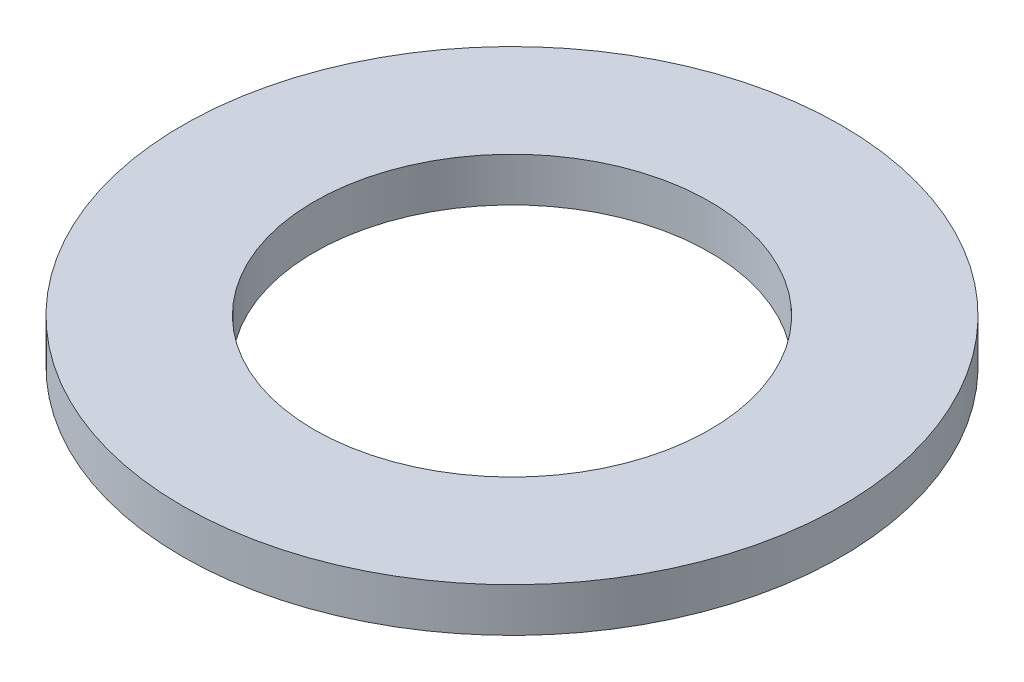
ISO-10303-21;
HEADER;
FILE_DESCRIPTION(('STEP AP214'),'2;1');
FILE_NAME('part.step','',(''),(''),'','','');
FILE_SCHEMA(('AUTOMOTIVE_DESIGN { 1 0 10303 214 1 1 1 1 }'));
ENDSEC;
DATA;
#1=APPLICATION_CONTEXT('core data for automotive mechanical design processes');
#2=APPLICATION_PROTOCOL_DEFINITION('international standard','automotive_design',2000,#1);
#3=PRODUCT_CONTEXT('',#1,'mechanical');
#4=PRODUCT('Part','Part','',(#3));
#5=PRODUCT_RELATED_PRODUCT_CATEGORY('part','',(#4));
#6=PRODUCT_DEFINITION_FORMATION('','',#4);
#7=PRODUCT_DEFINITION_CONTEXT('part definition',#1,'design');
#8=PRODUCT_DEFINITION('design','',#6,#7);
#9=PRODUCT_DEFINITION_SHAPE('','',#8);
#10=(LENGTH_UNIT() NAMED_UNIT(*) SI_UNIT(.MILLI.,.METRE.));
#11=(NAMED_UNIT(*) PLANE_ANGLE_UNIT() SI_UNIT($,.RADIAN.));
#12=(NAMED_UNIT(*) SI_UNIT($,.STERADIAN.) SOLID_ANGLE_UNIT());
#13=UNCERTAINTY_MEASURE_WITH_UNIT(LENGTH_MEASURE(1.E-05),#10,'distance_accuracy_value','');
#14=(GEOMETRIC_REPRESENTATION_CONTEXT(3) GLOBAL_UNCERTAINTY_ASSIGNED_CONTEXT((#13)) GLOBAL_UNIT_ASSIGNED_CONTEXT((#10,
#11,#12)) REPRESENTATION_CONTEXT('',''));
#15=CARTESIAN_POINT('',(0.,0.,0.));
#16=DIRECTION('',(0.,0.,1.));
#17=DIRECTION('',(1.,0.,0.));
#18=AXIS2_PLACEMENT_3D('',#15,#16,#17);
#19=CARTESIAN_POINT('',(0.,10.,0.));
#20=DIRECTION('',(0.,-1.,0.));
#21=DIRECTION('',(0.,0.,-1.));
#22=AXIS2_PLACEMENT_3D('',#19,#20,#21);
#23=CYLINDRICAL_SURFACE('',#22,75.);
#24=CARTESIAN_POINT('',(0.,10.,0.));
#25=DIRECTION('',(0.,1.,0.));
#26=DIRECTION('',(0.,0.,1.));
#27=AXIS2_PLACEMENT_3D('',#24,#25,#26);
#28=CIRCLE('',#27,75.);
#29=CARTESIAN_POINT('',(0.,10.,75.));
#30=VERTEX_POINT('',#29);
#31=EDGE_CURVE('E10',#30,#30,#28,.T.);
#32=ORIENTED_EDGE('',*,*,#31,.F.);
#33=EDGE_LOOP('',(#32));
#34=FACE_BOUND('',#33,.T.);
#35=CARTESIAN_POINT('',(0.,0.,0.));
#36=DIRECTION('',(0.,1.,0.));
#37=DIRECTION('',(0.,0.,1.));
#38=AXIS2_PLACEMENT_3D('',#35,#36,#37);
#39=CIRCLE('',#38,75.);
#40=CARTESIAN_POINT('',(0.,0.,75.));
#41=VERTEX_POINT('',#40);
#42=EDGE_CURVE('E37',#41,#41,#39,.T.);
#43=ORIENTED_EDGE('',*,*,#42,.T.);
#44=EDGE_LOOP('',(#43));
#45=FACE_BOUND('',#44,.T.);
#46=ADVANCED_FACE('F40',(#34,#45),#23,.T.);
#47=CARTESIAN_POINT('',(0.,10.,0.));
#48=DIRECTION('',(0.,1.,0.));
#49=DIRECTION('',(0.,0.,1.));
#50=AXIS2_PLACEMENT_3D('',#47,#48,#49);
#51=PLANE('',#50);
#52=CARTESIAN_POINT('',(0.,10.,0.));
#53=DIRECTION('',(0.,1.,0.));
#54=DIRECTION('',(0.,0.,1.));
#55=AXIS2_PLACEMENT_3D('',#52,#53,#54);
#56=CIRCLE('',#55,45.);
#57=CARTESIAN_POINT('',(0.,10.,45.));
#58=VERTEX_POINT('',#57);
#59=EDGE_CURVE('E50',#58,#58,#56,.T.);
#60=ORIENTED_EDGE('',*,*,#59,.F.);
#61=EDGE_LOOP('',(#60));
#62=FACE_BOUND('',#61,.T.);
#63=ORIENTED_EDGE('',*,*,#31,.T.);
#64=EDGE_LOOP('',(#63));
#65=FACE_BOUND('',#64,.T.);
#66=ADVANCED_FACE('F59',(#62,#65),#51,.T.);
#67=CARTESIAN_POINT('',(0.,0.,0.));
#68=DIRECTION('',(0.,1.,0.));
#69=DIRECTION('',(0.,0.,1.));
#70=AXIS2_PLACEMENT_3D('',#67,#68,#69);
#71=PLANE('',#70);
#72=CARTESIAN_POINT('',(0.,0.,0.));
#73=DIRECTION('',(0.,1.,0.));
#74=DIRECTION('',(0.,0.,1.));
#75=AXIS2_PLACEMENT_3D('',#72,#73,#74);
#76=CIRCLE('',#75,45.);
#77=CARTESIAN_POINT('',(0.,0.,45.));
#78=VERTEX_POINT('',#77);
#79=EDGE_CURVE('E47',#78,#78,#76,.T.);
#80=ORIENTED_EDGE('',*,*,#79,.T.);
#81=EDGE_LOOP('',(#80));
#82=FACE_BOUND('',#81,.T.);
#83=ORIENTED_EDGE('',*,*,#42,.F.);
#84=EDGE_LOOP('',(#83));
#85=FACE_BOUND('',#84,.T.);
#86=ADVANCED_FACE('F58',(#82,#85),#71,.F.);
#87=CARTESIAN_POINT('',(0.,10.,0.));
#88=DIRECTION('',(0.,-1.,0.));
#89=DIRECTION('',(0.,0.,-1.));
#90=AXIS2_PLACEMENT_3D('',#87,#88,#89);
#91=CYLINDRICAL_SURFACE('',#90,45.);
#92=ORIENTED_EDGE('',*,*,#59,.T.);
#93=EDGE_LOOP('',(#92));
#94=FACE_BOUND('',#93,.T.);
#95=ORIENTED_EDGE('',*,*,#79,.F.);
#96=EDGE_LOOP('',(#95));
#97=FACE_BOUND('',#96,.T.);
#98=ADVANCED_FACE('F54',(#94,#97),#91,.F.);
#99=CLOSED_SHELL('',(#46,#66,#86,#98));
#100=MANIFOLD_SOLID_BREP('B2',#99);
#101=ADVANCED_BREP_SHAPE_REPRESENTATION('',(#18,#100),#14);
#102=SHAPE_DEFINITION_REPRESENTATION(#9,#101);
ENDSEC;
END-ISO-10303-21;
